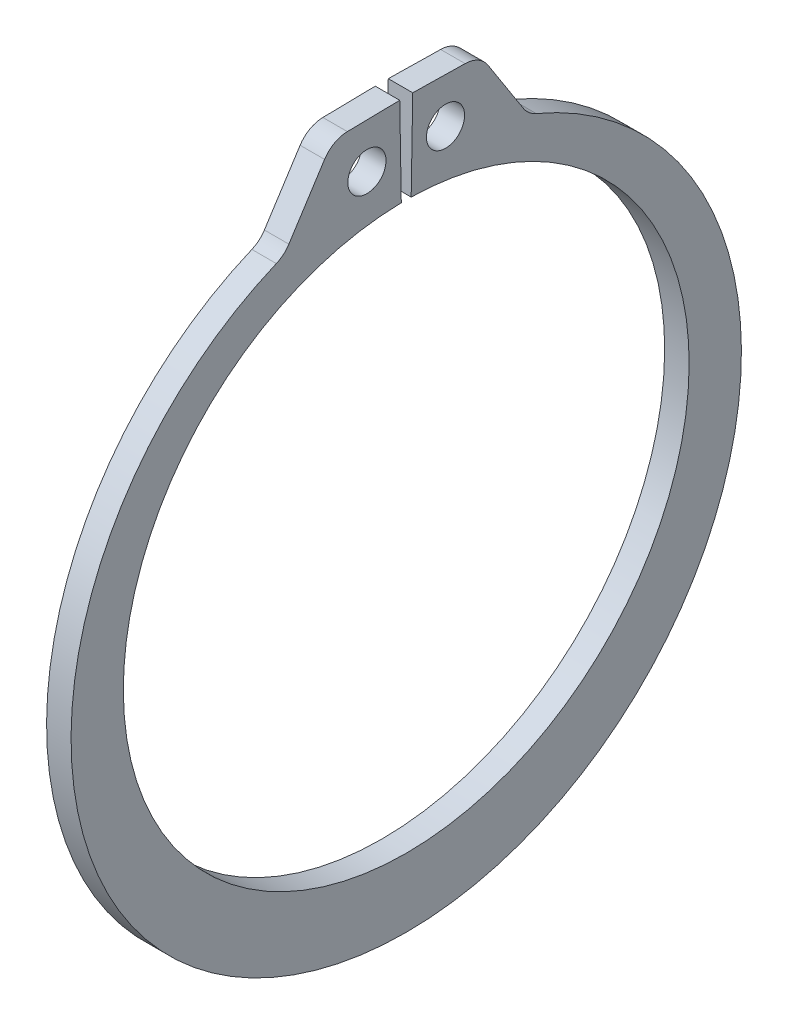
ISO-10303-21;
HEADER;
FILE_DESCRIPTION(('STEP AP214'),'2;1');
FILE_NAME('part.step','',(''),(''),'','','');
FILE_SCHEMA(('AUTOMOTIVE_DESIGN { 1 0 10303 214 1 1 1 1 }'));
ENDSEC;
DATA;
#1=APPLICATION_CONTEXT('core data for automotive mechanical design processes');
#2=APPLICATION_PROTOCOL_DEFINITION('international standard','automotive_design',2000,#1);
#3=PRODUCT_CONTEXT('',#1,'mechanical');
#4=PRODUCT('Part','Part','',(#3));
#5=PRODUCT_RELATED_PRODUCT_CATEGORY('part','',(#4));
#6=PRODUCT_DEFINITION_FORMATION('','',#4);
#7=PRODUCT_DEFINITION_CONTEXT('part definition',#1,'design');
#8=PRODUCT_DEFINITION('design','',#6,#7);
#9=PRODUCT_DEFINITION_SHAPE('','',#8);
#10=(LENGTH_UNIT() NAMED_UNIT(*) SI_UNIT(.MILLI.,.METRE.));
#11=(NAMED_UNIT(*) PLANE_ANGLE_UNIT() SI_UNIT($,.RADIAN.));
#12=(NAMED_UNIT(*) SI_UNIT($,.STERADIAN.) SOLID_ANGLE_UNIT());
#13=UNCERTAINTY_MEASURE_WITH_UNIT(LENGTH_MEASURE(1.E-05),#10,'distance_accuracy_value','');
#14=(GEOMETRIC_REPRESENTATION_CONTEXT(3) GLOBAL_UNCERTAINTY_ASSIGNED_CONTEXT((#13)) GLOBAL_UNIT_ASSIGNED_CONTEXT((#10,
#11,#12)) REPRESENTATION_CONTEXT('',''));
#15=CARTESIAN_POINT('',(0.,0.,0.));
#16=DIRECTION('',(0.,0.,1.));
#17=DIRECTION('',(1.,0.,0.));
#18=AXIS2_PLACEMENT_3D('',#15,#16,#17);
#19=CARTESIAN_POINT('',(0.635,0.,0.));
#20=DIRECTION('',(1.,0.,0.));
#21=DIRECTION('',(0.,0.,-1.));
#22=AXIS2_PLACEMENT_3D('',#19,#20,#21);
#23=PLANE('',#22);
#24=CARTESIAN_POINT('',(0.635,16.9722891570923,2.03959292842269));
#25=DIRECTION('',(1.,0.,0.));
#26=DIRECTION('',(0.,0.,-1.));
#27=AXIS2_PLACEMENT_3D('',#24,#25,#26);
#28=CIRCLE('',#27,0.9906);
#29=CARTESIAN_POINT('',(0.635,16.9722891570923,1.04899292842269));
#30=VERTEX_POINT('',#29);
#31=EDGE_CURVE('E221',#30,#30,#28,.T.);
#32=ORIENTED_EDGE('',*,*,#31,.F.);
#33=EDGE_LOOP('',(#32));
#34=FACE_BOUND('',#33,.T.);
#35=DIRECTION('',(0.,-0.0174524064372853,0.999847695156391));
#36=VECTOR('',#35,1.);
#37=CARTESIAN_POINT('',(0.635,19.3264560387559,0.337344544988828));
#38=LINE('',#37,#36);
#39=CARTESIAN_POINT('',(0.635,19.3264560387559,0.337344544988828));
#40=VERTEX_POINT('',#39);
#41=CARTESIAN_POINT('',(0.635,19.2790060872022,3.05575044888675));
#42=VERTEX_POINT('',#41);
#43=EDGE_CURVE('E133',#40,#42,#38,.T.);
#44=ORIENTED_EDGE('',*,*,#43,.T.);
#45=CARTESIAN_POINT('',(0.635,17.8441246598832,3.0307045004086));
#46=DIRECTION('',(1.,0.,0.));
#47=DIRECTION('',(0.,0.,-1.));
#48=AXIS2_PLACEMENT_3D('',#45,#46,#47);
#49=CIRCLE('',#48,1.4351);
#50=CARTESIAN_POINT('',(0.635,18.6201460214115,4.23789249589718));
#51=VERTEX_POINT('',#50);
#52=EDGE_CURVE('E174',#42,#51,#49,.T.);
#53=ORIENTED_EDGE('',*,*,#52,.T.);
#54=DIRECTION('',(0.,-0.841187370558551,0.540743754113528));
#55=VECTOR('',#54,1.);
#56=CARTESIAN_POINT('',(0.635,19.2656143320546,3.82296358745828));
#57=LINE('',#56,#55);
#58=CARTESIAN_POINT('',(0.635,15.7381747794727,6.09052129556451));
#59=VERTEX_POINT('',#58);
#60=EDGE_CURVE('E213',#51,#59,#57,.T.);
#61=ORIENTED_EDGE('',*,*,#60,.T.);
#62=CARTESIAN_POINT('',(0.635,16.5141961410011,7.29770929105309));
#63=DIRECTION('',(1.,0.,0.));
#64=DIRECTION('',(0.,0.,-1.));
#65=AXIS2_PLACEMENT_3D('',#62,#63,#64);
#66=CIRCLE('',#65,1.4351);
#67=CARTESIAN_POINT('',(0.635,15.1912667160959,6.74149912688847));
#68=VERTEX_POINT('',#67);
#69=EDGE_CURVE('E181',#59,#68,#66,.F.);
#70=ORIENTED_EDGE('',*,*,#69,.T.);
#71=CARTESIAN_POINT('',(0.635,-0.843189569557128,0.));
#72=DIRECTION('',(1.,0.,0.));
#73=DIRECTION('',(0.,0.,-1.));
#74=AXIS2_PLACEMENT_3D('',#71,#72,#73);
#75=CIRCLE('',#74,17.3940104304429);
#76=CARTESIAN_POINT('',(0.635,15.1912667160959,-6.74149912688847));
#77=VERTEX_POINT('',#76);
#78=EDGE_CURVE('E206',#68,#77,#75,.T.);
#79=ORIENTED_EDGE('',*,*,#78,.T.);
#80=CARTESIAN_POINT('',(0.635,16.5141961410011,-7.29770929105309));
#81=DIRECTION('',(1.,0.,0.));
#82=DIRECTION('',(0.,0.,-1.));
#83=AXIS2_PLACEMENT_3D('',#80,#81,#82);
#84=CIRCLE('',#83,1.4351);
#85=CARTESIAN_POINT('',(0.635,15.7381747794727,-6.09052129556451));
#86=VERTEX_POINT('',#85);
#87=EDGE_CURVE('E11',#77,#86,#84,.F.);
#88=ORIENTED_EDGE('',*,*,#87,.T.);
#89=DIRECTION('',(0.,0.841187370558551,0.540743754113528));
#90=VECTOR('',#89,1.);
#91=CARTESIAN_POINT('',(0.635,19.2656143320546,-3.82296358745828));
#92=LINE('',#91,#90);
#93=CARTESIAN_POINT('',(0.635,18.6201460214115,-4.23789249589718));
#94=VERTEX_POINT('',#93);
#95=EDGE_CURVE('E205',#86,#94,#92,.T.);
#96=ORIENTED_EDGE('',*,*,#95,.T.);
#97=CARTESIAN_POINT('',(0.635,17.8441246598832,-3.0307045004086));
#98=DIRECTION('',(1.,0.,0.));
#99=DIRECTION('',(0.,0.,-1.));
#100=AXIS2_PLACEMENT_3D('',#97,#98,#99);
#101=CIRCLE('',#100,1.4351);
#102=CARTESIAN_POINT('',(0.635,19.2790060872022,-3.05575044888675));
#103=VERTEX_POINT('',#102);
#104=EDGE_CURVE('E49',#94,#103,#101,.T.);
#105=ORIENTED_EDGE('',*,*,#104,.T.);
#106=DIRECTION('',(0.,0.0174524064372853,0.999847695156391));
#107=VECTOR('',#106,1.);
#108=CARTESIAN_POINT('',(0.635,19.3264560387559,-0.337344544988828));
#109=LINE('',#108,#107);
#110=CARTESIAN_POINT('',(0.635,19.3264560387559,-0.337344544988828));
#111=VERTEX_POINT('',#110);
#112=EDGE_CURVE('E210',#103,#111,#109,.T.);
#113=ORIENTED_EDGE('',*,*,#112,.T.);
#114=DIRECTION('',(0.,-0.999847695156391,0.0174524064372834));
#115=VECTOR('',#114,1.);
#116=CARTESIAN_POINT('',(0.635,14.67896398213,-0.256222269387047));
#117=LINE('',#116,#115);
#118=CARTESIAN_POINT('',(0.635,14.67896398213,-0.256222269387047));
#119=VERTEX_POINT('',#118);
#120=EDGE_CURVE('E139',#111,#119,#117,.T.);
#121=ORIENTED_EDGE('',*,*,#120,.T.);
#122=CARTESIAN_POINT('',(0.635,0.,0.));
#123=DIRECTION('',(-1.,0.,0.));
#124=DIRECTION('',(0.,0.,-1.));
#125=AXIS2_PLACEMENT_3D('',#122,#123,#124);
#126=CIRCLE('',#125,14.6812);
#127=CARTESIAN_POINT('',(0.635,14.67896398213,0.256222269387047));
#128=VERTEX_POINT('',#127);
#129=EDGE_CURVE('E134',#119,#128,#126,.T.);
#130=ORIENTED_EDGE('',*,*,#129,.T.);
#131=DIRECTION('',(0.,0.999847695156391,0.0174524064372834));
#132=VECTOR('',#131,1.);
#133=CARTESIAN_POINT('',(0.635,14.67896398213,0.256222269387047));
#134=LINE('',#133,#132);
#135=EDGE_CURVE('E125',#128,#40,#134,.T.);
#136=ORIENTED_EDGE('',*,*,#135,.T.);
#137=EDGE_LOOP('',(#44,#53,#61,#70,#79,#88,#96,#105,#113,#121,#130,#136));
#138=FACE_BOUND('',#137,.T.);
#139=CARTESIAN_POINT('',(0.635,16.9722891570923,-2.03959292842269));
#140=DIRECTION('',(1.,0.,0.));
#141=DIRECTION('',(0.,0.,-1.));
#142=AXIS2_PLACEMENT_3D('',#139,#140,#141);
#143=CIRCLE('',#142,0.9906);
#144=CARTESIAN_POINT('',(0.635,16.9722891570923,-3.03019292842269));
#145=VERTEX_POINT('',#144);
#146=EDGE_CURVE('E247',#145,#145,#143,.T.);
#147=ORIENTED_EDGE('',*,*,#146,.F.);
#148=EDGE_LOOP('',(#147));
#149=FACE_BOUND('',#148,.T.);
#150=ADVANCED_FACE('F34',(#34,#138,#149),#23,.T.);
#151=CARTESIAN_POINT('',(-0.635,0.,0.));
#152=DIRECTION('',(1.,0.,0.));
#153=DIRECTION('',(0.,0.,-1.));
#154=AXIS2_PLACEMENT_3D('',#151,#152,#153);
#155=PLANE('',#154);
#156=CARTESIAN_POINT('',(-0.635,16.9722891570923,2.03959292842269));
#157=DIRECTION('',(1.,0.,0.));
#158=DIRECTION('',(0.,0.,-1.));
#159=AXIS2_PLACEMENT_3D('',#156,#157,#158);
#160=CIRCLE('',#159,0.9906);
#161=CARTESIAN_POINT('',(-0.635,16.9722891570923,1.04899292842269));
#162=VERTEX_POINT('',#161);
#163=EDGE_CURVE('E244',#162,#162,#160,.T.);
#164=ORIENTED_EDGE('',*,*,#163,.T.);
#165=EDGE_LOOP('',(#164));
#166=FACE_BOUND('',#165,.T.);
#167=DIRECTION('',(0.,-0.841187370558551,0.540743754113528));
#168=VECTOR('',#167,1.);
#169=CARTESIAN_POINT('',(-0.635,19.2656143320546,3.82296358745828));
#170=LINE('',#169,#168);
#171=CARTESIAN_POINT('',(-0.635,18.6201460214115,4.23789249589718));
#172=VERTEX_POINT('',#171);
#173=CARTESIAN_POINT('',(-0.635,15.7381747794727,6.09052129556451));
#174=VERTEX_POINT('',#173);
#175=EDGE_CURVE('E200',#172,#174,#170,.T.);
#176=ORIENTED_EDGE('',*,*,#175,.F.);
#177=CARTESIAN_POINT('',(-0.635,17.8441246598832,3.0307045004086));
#178=DIRECTION('',(1.,0.,0.));
#179=DIRECTION('',(0.,0.,-1.));
#180=AXIS2_PLACEMENT_3D('',#177,#178,#179);
#181=CIRCLE('',#180,1.4351);
#182=CARTESIAN_POINT('',(-0.635,19.2790060872022,3.05575044888675));
#183=VERTEX_POINT('',#182);
#184=EDGE_CURVE('E170',#172,#183,#181,.F.);
#185=ORIENTED_EDGE('',*,*,#184,.T.);
#186=DIRECTION('',(0.,-0.0174524064372853,0.999847695156391));
#187=VECTOR('',#186,1.);
#188=CARTESIAN_POINT('',(-0.635,19.3264560387559,0.337344544988828));
#189=LINE('',#188,#187);
#190=CARTESIAN_POINT('',(-0.635,19.3264560387559,0.337344544988828));
#191=VERTEX_POINT('',#190);
#192=EDGE_CURVE('E223',#191,#183,#189,.T.);
#193=ORIENTED_EDGE('',*,*,#192,.F.);
#194=DIRECTION('',(0.,0.999847695156391,0.0174524064372834));
#195=VECTOR('',#194,1.);
#196=CARTESIAN_POINT('',(-0.635,14.67896398213,0.256222269387047));
#197=LINE('',#196,#195);
#198=CARTESIAN_POINT('',(-0.635,14.67896398213,0.256222269387047));
#199=VERTEX_POINT('',#198);
#200=EDGE_CURVE('E220',#199,#191,#197,.T.);
#201=ORIENTED_EDGE('',*,*,#200,.F.);
#202=CARTESIAN_POINT('',(-0.635,0.,0.));
#203=DIRECTION('',(-1.,0.,0.));
#204=DIRECTION('',(0.,0.,-1.));
#205=AXIS2_PLACEMENT_3D('',#202,#203,#204);
#206=CIRCLE('',#205,14.6812);
#207=CARTESIAN_POINT('',(-0.635,14.67896398213,-0.256222269387047));
#208=VERTEX_POINT('',#207);
#209=EDGE_CURVE('E147',#208,#199,#206,.T.);
#210=ORIENTED_EDGE('',*,*,#209,.F.);
#211=DIRECTION('',(0.,-0.999847695156391,0.0174524064372834));
#212=VECTOR('',#211,1.);
#213=CARTESIAN_POINT('',(-0.635,14.67896398213,-0.256222269387047));
#214=LINE('',#213,#212);
#215=CARTESIAN_POINT('',(-0.635,19.3264560387559,-0.337344544988828));
#216=VERTEX_POINT('',#215);
#217=EDGE_CURVE('E143',#216,#208,#214,.T.);
#218=ORIENTED_EDGE('',*,*,#217,.F.);
#219=DIRECTION('',(0.,0.0174524064372853,0.999847695156391));
#220=VECTOR('',#219,1.);
#221=CARTESIAN_POINT('',(-0.635,19.3264560387559,-0.337344544988828));
#222=LINE('',#221,#220);
#223=CARTESIAN_POINT('',(-0.635,19.2790060872022,-3.05575044888675));
#224=VERTEX_POINT('',#223);
#225=EDGE_CURVE('E228',#224,#216,#222,.T.);
#226=ORIENTED_EDGE('',*,*,#225,.F.);
#227=CARTESIAN_POINT('',(-0.635,17.8441246598832,-3.0307045004086));
#228=DIRECTION('',(1.,0.,0.));
#229=DIRECTION('',(0.,0.,-1.));
#230=AXIS2_PLACEMENT_3D('',#227,#228,#229);
#231=CIRCLE('',#230,1.4351);
#232=CARTESIAN_POINT('',(-0.635,18.6201460214115,-4.23789249589718));
#233=VERTEX_POINT('',#232);
#234=EDGE_CURVE('E168',#224,#233,#231,.F.);
#235=ORIENTED_EDGE('',*,*,#234,.T.);
#236=DIRECTION('',(0.,0.841187370558551,0.540743754113528));
#237=VECTOR('',#236,1.);
#238=CARTESIAN_POINT('',(-0.635,19.2656143320546,-3.82296358745828));
#239=LINE('',#238,#237);
#240=CARTESIAN_POINT('',(-0.635,15.7381747794727,-6.09052129556451));
#241=VERTEX_POINT('',#240);
#242=EDGE_CURVE('E191',#241,#233,#239,.T.);
#243=ORIENTED_EDGE('',*,*,#242,.F.);
#244=CARTESIAN_POINT('',(-0.635,16.5141961410011,-7.29770929105309));
#245=DIRECTION('',(1.,0.,0.));
#246=DIRECTION('',(0.,0.,-1.));
#247=AXIS2_PLACEMENT_3D('',#244,#245,#246);
#248=CIRCLE('',#247,1.4351);
#249=CARTESIAN_POINT('',(-0.635,15.1912667160959,-6.74149912688847));
#250=VERTEX_POINT('',#249);
#251=EDGE_CURVE('E42',#241,#250,#248,.T.);
#252=ORIENTED_EDGE('',*,*,#251,.T.);
#253=CARTESIAN_POINT('',(-0.635,-0.843189569557128,0.));
#254=DIRECTION('',(1.,0.,0.));
#255=DIRECTION('',(0.,0.,-1.));
#256=AXIS2_PLACEMENT_3D('',#253,#254,#255);
#257=CIRCLE('',#256,17.3940104304429);
#258=CARTESIAN_POINT('',(-0.635,15.1912667160959,6.74149912688847));
#259=VERTEX_POINT('',#258);
#260=EDGE_CURVE('E189',#259,#250,#257,.T.);
#261=ORIENTED_EDGE('',*,*,#260,.F.);
#262=CARTESIAN_POINT('',(-0.635,16.5141961410011,7.29770929105309));
#263=DIRECTION('',(1.,0.,0.));
#264=DIRECTION('',(0.,0.,-1.));
#265=AXIS2_PLACEMENT_3D('',#262,#263,#264);
#266=CIRCLE('',#265,1.4351);
#267=EDGE_CURVE('E179',#259,#174,#266,.T.);
#268=ORIENTED_EDGE('',*,*,#267,.T.);
#269=EDGE_LOOP('',(#176,#185,#193,#201,#210,#218,#226,#235,#243,#252,#261,#268));
#270=FACE_BOUND('',#269,.T.);
#271=CARTESIAN_POINT('',(-0.635,16.9722891570923,-2.03959292842269));
#272=DIRECTION('',(1.,0.,0.));
#273=DIRECTION('',(0.,0.,-1.));
#274=AXIS2_PLACEMENT_3D('',#271,#272,#273);
#275=CIRCLE('',#274,0.9906);
#276=CARTESIAN_POINT('',(-0.635,16.9722891570923,-3.03019292842269));
#277=VERTEX_POINT('',#276);
#278=EDGE_CURVE('E250',#277,#277,#275,.T.);
#279=ORIENTED_EDGE('',*,*,#278,.T.);
#280=EDGE_LOOP('',(#279));
#281=FACE_BOUND('',#280,.T.);
#282=ADVANCED_FACE('F187',(#166,#270,#281),#155,.F.);
#283=CARTESIAN_POINT('',(0.635,0.,0.));
#284=DIRECTION('',(-1.,0.,0.));
#285=DIRECTION('',(0.,0.,1.));
#286=AXIS2_PLACEMENT_3D('',#283,#284,#285);
#287=CYLINDRICAL_SURFACE('',#286,14.6812);
#288=ORIENTED_EDGE('',*,*,#209,.T.);
#289=DIRECTION('',(-1.,0.,0.));
#290=VECTOR('',#289,1.);
#291=CARTESIAN_POINT('',(0.635,14.67896398213,0.256222269387047));
#292=LINE('',#291,#290);
#293=EDGE_CURVE('E129',#128,#199,#292,.T.);
#294=ORIENTED_EDGE('',*,*,#293,.F.);
#295=ORIENTED_EDGE('',*,*,#129,.F.);
#296=DIRECTION('',(-1.,0.,0.));
#297=VECTOR('',#296,1.);
#298=CARTESIAN_POINT('',(0.635,14.67896398213,-0.256222269387047));
#299=LINE('',#298,#297);
#300=EDGE_CURVE('E218',#119,#208,#299,.T.);
#301=ORIENTED_EDGE('',*,*,#300,.T.);
#302=EDGE_LOOP('',(#288,#294,#295,#301));
#303=FACE_BOUND('',#302,.T.);
#304=ADVANCED_FACE('F145',(#303),#287,.F.);
#305=CARTESIAN_POINT('',(0.635,14.67896398213,0.256222269387047));
#306=DIRECTION('',(0.,-0.0174524064372834,0.999847695156391));
#307=DIRECTION('',(0.,-0.999847695156391,-0.0174524064372834));
#308=AXIS2_PLACEMENT_3D('',#305,#306,#307);
#309=PLANE('',#308);
#310=ORIENTED_EDGE('',*,*,#200,.T.);
#311=DIRECTION('',(-1.,0.,0.));
#312=VECTOR('',#311,1.);
#313=CARTESIAN_POINT('',(0.635,19.3264560387559,0.337344544988828));
#314=LINE('',#313,#312);
#315=EDGE_CURVE('E132',#40,#191,#314,.T.);
#316=ORIENTED_EDGE('',*,*,#315,.F.);
#317=ORIENTED_EDGE('',*,*,#135,.F.);
#318=ORIENTED_EDGE('',*,*,#293,.T.);
#319=EDGE_LOOP('',(#310,#316,#317,#318));
#320=FACE_BOUND('',#319,.T.);
#321=ADVANCED_FACE('F127',(#320),#309,.F.);
#322=CARTESIAN_POINT('',(0.635,19.3264560387559,0.337344544988828));
#323=DIRECTION('',(0.,-0.999847695156391,-0.0174524064372853));
#324=DIRECTION('',(0.,0.0174524064372853,-0.999847695156391));
#325=AXIS2_PLACEMENT_3D('',#322,#323,#324);
#326=PLANE('',#325);
#327=ORIENTED_EDGE('',*,*,#192,.T.);
#328=DIRECTION('',(-1.,0.,0.));
#329=VECTOR('',#328,1.);
#330=CARTESIAN_POINT('',(0.635,19.2790060872022,3.05575044888675));
#331=LINE('',#330,#329);
#332=EDGE_CURVE('E57',#183,#42,#331,.F.);
#333=ORIENTED_EDGE('',*,*,#332,.T.);
#334=ORIENTED_EDGE('',*,*,#43,.F.);
#335=ORIENTED_EDGE('',*,*,#315,.T.);
#336=EDGE_LOOP('',(#327,#333,#334,#335));
#337=FACE_BOUND('',#336,.T.);
#338=ADVANCED_FACE('F239',(#337),#326,.F.);
#339=CARTESIAN_POINT('',(0.635,19.2656143320546,3.82296358745828));
#340=DIRECTION('',(0.,-0.540743754113527,-0.841187370558551));
#341=DIRECTION('',(0.,0.841187370558551,-0.540743754113528));
#342=AXIS2_PLACEMENT_3D('',#339,#340,#341);
#343=PLANE('',#342);
#344=ORIENTED_EDGE('',*,*,#175,.T.);
#345=DIRECTION('',(1.,0.,0.));
#346=VECTOR('',#345,1.);
#347=CARTESIAN_POINT('',(0.635,15.7381747794727,6.09052129556451));
#348=LINE('',#347,#346);
#349=EDGE_CURVE('E161',#174,#59,#348,.T.);
#350=ORIENTED_EDGE('',*,*,#349,.T.);
#351=ORIENTED_EDGE('',*,*,#60,.F.);
#352=DIRECTION('',(-1.,0.,0.));
#353=VECTOR('',#352,1.);
#354=CARTESIAN_POINT('',(0.635,18.6201460214115,4.23789249589718));
#355=LINE('',#354,#353);
#356=EDGE_CURVE('E158',#51,#172,#355,.T.);
#357=ORIENTED_EDGE('',*,*,#356,.T.);
#358=EDGE_LOOP('',(#344,#350,#351,#357));
#359=FACE_BOUND('',#358,.T.);
#360=ADVANCED_FACE('F280',(#359),#343,.F.);
#361=CARTESIAN_POINT('',(0.635,-0.843189569557128,0.));
#362=DIRECTION('',(-1.,0.,0.));
#363=DIRECTION('',(0.,0.,1.));
#364=AXIS2_PLACEMENT_3D('',#361,#362,#363);
#365=CYLINDRICAL_SURFACE('',#364,17.3940104304429);
#366=ORIENTED_EDGE('',*,*,#78,.F.);
#367=DIRECTION('',(-1.,0.,0.));
#368=VECTOR('',#367,1.);
#369=CARTESIAN_POINT('',(0.635,15.1912667160959,6.74149912688847));
#370=LINE('',#369,#368);
#371=EDGE_CURVE('E150',#68,#259,#370,.T.);
#372=ORIENTED_EDGE('',*,*,#371,.T.);
#373=ORIENTED_EDGE('',*,*,#260,.T.);
#374=DIRECTION('',(-1.,0.,0.));
#375=VECTOR('',#374,1.);
#376=CARTESIAN_POINT('',(0.635,15.1912667160959,-6.74149912688847));
#377=LINE('',#376,#375);
#378=EDGE_CURVE('E148',#250,#77,#377,.F.);
#379=ORIENTED_EDGE('',*,*,#378,.T.);
#380=EDGE_LOOP('',(#366,#372,#373,#379));
#381=FACE_BOUND('',#380,.T.);
#382=ADVANCED_FACE('F197',(#381),#365,.T.);
#383=CARTESIAN_POINT('',(0.635,19.2656143320546,-3.82296358745828));
#384=DIRECTION('',(0.,-0.540743754113527,0.841187370558551));
#385=DIRECTION('',(0.,-0.841187370558551,-0.540743754113528));
#386=AXIS2_PLACEMENT_3D('',#383,#384,#385);
#387=PLANE('',#386);
#388=ORIENTED_EDGE('',*,*,#95,.F.);
#389=DIRECTION('',(1.,0.,0.));
#390=VECTOR('',#389,1.);
#391=CARTESIAN_POINT('',(-0.635,15.7381747794727,-6.09052129556451));
#392=LINE('',#391,#390);
#393=EDGE_CURVE('E165',#86,#241,#392,.F.);
#394=ORIENTED_EDGE('',*,*,#393,.T.);
#395=ORIENTED_EDGE('',*,*,#242,.T.);
#396=DIRECTION('',(-1.,0.,0.));
#397=VECTOR('',#396,1.);
#398=CARTESIAN_POINT('',(0.635,18.6201460214115,-4.23789249589718));
#399=LINE('',#398,#397);
#400=EDGE_CURVE('E163',#233,#94,#399,.F.);
#401=ORIENTED_EDGE('',*,*,#400,.T.);
#402=EDGE_LOOP('',(#388,#394,#395,#401));
#403=FACE_BOUND('',#402,.T.);
#404=ADVANCED_FACE('F208',(#403),#387,.F.);
#405=CARTESIAN_POINT('',(0.635,19.3264560387559,-0.337344544988828));
#406=DIRECTION('',(0.,-0.999847695156391,0.0174524064372853));
#407=DIRECTION('',(0.,-0.0174524064372853,-0.999847695156391));
#408=AXIS2_PLACEMENT_3D('',#405,#406,#407);
#409=PLANE('',#408);
#410=ORIENTED_EDGE('',*,*,#112,.F.);
#411=DIRECTION('',(-1.,0.,0.));
#412=VECTOR('',#411,1.);
#413=CARTESIAN_POINT('',(0.635,19.2790060872022,-3.05575044888675));
#414=LINE('',#413,#412);
#415=EDGE_CURVE('E176',#103,#224,#414,.T.);
#416=ORIENTED_EDGE('',*,*,#415,.T.);
#417=ORIENTED_EDGE('',*,*,#225,.T.);
#418=DIRECTION('',(-1.,0.,0.));
#419=VECTOR('',#418,1.);
#420=CARTESIAN_POINT('',(0.635,19.3264560387559,-0.337344544988828));
#421=LINE('',#420,#419);
#422=EDGE_CURVE('E152',#111,#216,#421,.T.);
#423=ORIENTED_EDGE('',*,*,#422,.F.);
#424=EDGE_LOOP('',(#410,#416,#417,#423));
#425=FACE_BOUND('',#424,.T.);
#426=ADVANCED_FACE('F273',(#425),#409,.F.);
#427=CARTESIAN_POINT('',(0.635,14.67896398213,-0.256222269387047));
#428=DIRECTION('',(0.,-0.0174524064372834,-0.999847695156391));
#429=DIRECTION('',(0.,0.999847695156391,-0.0174524064372834));
#430=AXIS2_PLACEMENT_3D('',#427,#428,#429);
#431=PLANE('',#430);
#432=ORIENTED_EDGE('',*,*,#217,.T.);
#433=ORIENTED_EDGE('',*,*,#300,.F.);
#434=ORIENTED_EDGE('',*,*,#120,.F.);
#435=ORIENTED_EDGE('',*,*,#422,.T.);
#436=EDGE_LOOP('',(#432,#433,#434,#435));
#437=FACE_BOUND('',#436,.T.);
#438=ADVANCED_FACE('F235',(#437),#431,.F.);
#439=CARTESIAN_POINT('',(0.635,16.9722891570923,2.03959292842269));
#440=DIRECTION('',(-1.,0.,0.));
#441=DIRECTION('',(0.,0.,1.));
#442=AXIS2_PLACEMENT_3D('',#439,#440,#441);
#443=CYLINDRICAL_SURFACE('',#442,0.9906);
#444=ORIENTED_EDGE('',*,*,#31,.T.);
#445=EDGE_LOOP('',(#444));
#446=FACE_BOUND('',#445,.T.);
#447=ORIENTED_EDGE('',*,*,#163,.F.);
#448=EDGE_LOOP('',(#447));
#449=FACE_BOUND('',#448,.T.);
#450=ADVANCED_FACE('F268',(#446,#449),#443,.F.);
#451=CARTESIAN_POINT('',(0.635,16.9722891570923,-2.03959292842269));
#452=DIRECTION('',(-1.,0.,0.));
#453=DIRECTION('',(0.,0.,1.));
#454=AXIS2_PLACEMENT_3D('',#451,#452,#453);
#455=CYLINDRICAL_SURFACE('',#454,0.9906);
#456=ORIENTED_EDGE('',*,*,#146,.T.);
#457=EDGE_LOOP('',(#456));
#458=FACE_BOUND('',#457,.T.);
#459=ORIENTED_EDGE('',*,*,#278,.F.);
#460=EDGE_LOOP('',(#459));
#461=FACE_BOUND('',#460,.T.);
#462=ADVANCED_FACE('F256',(#458,#461),#455,.F.);
#463=CARTESIAN_POINT('',(0.635,16.5141961410011,7.29770929105309));
#464=DIRECTION('',(-1.,0.,0.));
#465=DIRECTION('',(0.,0.,1.));
#466=AXIS2_PLACEMENT_3D('',#463,#464,#465);
#467=CYLINDRICAL_SURFACE('',#466,1.4351);
#468=ORIENTED_EDGE('',*,*,#69,.F.);
#469=ORIENTED_EDGE('',*,*,#349,.F.);
#470=ORIENTED_EDGE('',*,*,#267,.F.);
#471=ORIENTED_EDGE('',*,*,#371,.F.);
#472=EDGE_LOOP('',(#468,#469,#470,#471));
#473=FACE_BOUND('',#472,.T.);
#474=ADVANCED_FACE('F290',(#473),#467,.F.);
#475=CARTESIAN_POINT('',(0.635,16.5141961410011,-7.29770929105309));
#476=DIRECTION('',(-1.,0.,0.));
#477=DIRECTION('',(0.,0.,1.));
#478=AXIS2_PLACEMENT_3D('',#475,#476,#477);
#479=CYLINDRICAL_SURFACE('',#478,1.4351);
#480=ORIENTED_EDGE('',*,*,#87,.F.);
#481=ORIENTED_EDGE('',*,*,#378,.F.);
#482=ORIENTED_EDGE('',*,*,#251,.F.);
#483=ORIENTED_EDGE('',*,*,#393,.F.);
#484=EDGE_LOOP('',(#480,#481,#482,#483));
#485=FACE_BOUND('',#484,.T.);
#486=ADVANCED_FACE('F203',(#485),#479,.F.);
#487=CARTESIAN_POINT('',(0.635,17.8441246598832,3.0307045004086));
#488=DIRECTION('',(-1.,0.,0.));
#489=DIRECTION('',(0.,0.,1.));
#490=AXIS2_PLACEMENT_3D('',#487,#488,#489);
#491=CYLINDRICAL_SURFACE('',#490,1.4351);
#492=ORIENTED_EDGE('',*,*,#52,.F.);
#493=ORIENTED_EDGE('',*,*,#332,.F.);
#494=ORIENTED_EDGE('',*,*,#184,.F.);
#495=ORIENTED_EDGE('',*,*,#356,.F.);
#496=EDGE_LOOP('',(#492,#493,#494,#495));
#497=FACE_BOUND('',#496,.T.);
#498=ADVANCED_FACE('F295',(#497),#491,.T.);
#499=CARTESIAN_POINT('',(0.635,17.8441246598832,-3.0307045004086));
#500=DIRECTION('',(-1.,0.,0.));
#501=DIRECTION('',(0.,0.,1.));
#502=AXIS2_PLACEMENT_3D('',#499,#500,#501);
#503=CYLINDRICAL_SURFACE('',#502,1.4351);
#504=ORIENTED_EDGE('',*,*,#104,.F.);
#505=ORIENTED_EDGE('',*,*,#400,.F.);
#506=ORIENTED_EDGE('',*,*,#234,.F.);
#507=ORIENTED_EDGE('',*,*,#415,.F.);
#508=EDGE_LOOP('',(#504,#505,#506,#507));
#509=FACE_BOUND('',#508,.T.);
#510=ADVANCED_FACE('F36',(#509),#503,.T.);
#511=CLOSED_SHELL('',(#150,#282,#304,#321,#338,#360,#382,#404,#426,#438,#450,#462,#474,#486,
#498,#510));
#512=MANIFOLD_SOLID_BREP('B2',#511);
#513=ADVANCED_BREP_SHAPE_REPRESENTATION('',(#18,#512),#14);
#514=SHAPE_DEFINITION_REPRESENTATION(#9,#513);
ENDSEC;
END-ISO-10303-21;
